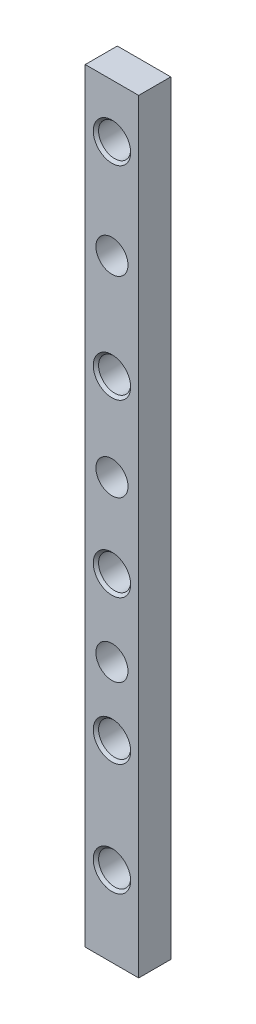
ISO-10303-21;
HEADER;
FILE_DESCRIPTION(('STEP AP214'),'2;1');
FILE_NAME('part.step','',(''),(''),'','','');
FILE_SCHEMA(('AUTOMOTIVE_DESIGN { 1 0 10303 214 1 1 1 1 }'));
ENDSEC;
DATA;
#1=APPLICATION_CONTEXT('core data for automotive mechanical design processes');
#2=APPLICATION_PROTOCOL_DEFINITION('international standard','automotive_design',2000,#1);
#3=PRODUCT_CONTEXT('',#1,'mechanical');
#4=PRODUCT('Part','Part','',(#3));
#5=PRODUCT_RELATED_PRODUCT_CATEGORY('part','',(#4));
#6=PRODUCT_DEFINITION_FORMATION('','',#4);
#7=PRODUCT_DEFINITION_CONTEXT('part definition',#1,'design');
#8=PRODUCT_DEFINITION('design','',#6,#7);
#9=PRODUCT_DEFINITION_SHAPE('','',#8);
#10=(LENGTH_UNIT() NAMED_UNIT(*) SI_UNIT(.MILLI.,.METRE.));
#11=(NAMED_UNIT(*) PLANE_ANGLE_UNIT() SI_UNIT($,.RADIAN.));
#12=(NAMED_UNIT(*) SI_UNIT($,.STERADIAN.) SOLID_ANGLE_UNIT());
#13=UNCERTAINTY_MEASURE_WITH_UNIT(LENGTH_MEASURE(1.E-05),#10,'distance_accuracy_value','');
#14=(GEOMETRIC_REPRESENTATION_CONTEXT(3) GLOBAL_UNCERTAINTY_ASSIGNED_CONTEXT((#13)) GLOBAL_UNIT_ASSIGNED_CONTEXT((#10,
#11,#12)) REPRESENTATION_CONTEXT('',''));
#15=CARTESIAN_POINT('',(0.,0.,0.));
#16=DIRECTION('',(0.,0.,1.));
#17=DIRECTION('',(1.,0.,0.));
#18=AXIS2_PLACEMENT_3D('',#15,#16,#17);
#19=CARTESIAN_POINT('',(0.,0.,6.));
#20=DIRECTION('',(0.,0.,-1.));
#21=DIRECTION('',(-1.,0.,0.));
#22=AXIS2_PLACEMENT_3D('',#19,#20,#21);
#23=PLANE('',#22);
#24=CARTESIAN_POINT('',(0.,61.5,6.));
#25=DIRECTION('',(0.,0.,-1.));
#26=DIRECTION('',(-1.,0.,0.));
#27=AXIS2_PLACEMENT_3D('',#24,#25,#26);
#28=CIRCLE('',#27,3.50000000000002);
#29=CARTESIAN_POINT('',(-3.50000000000002,61.5,6.));
#30=VERTEX_POINT('',#29);
#31=EDGE_CURVE('E129',#30,#30,#28,.T.);
#32=ORIENTED_EDGE('',*,*,#31,.T.);
#33=EDGE_LOOP('',(#32));
#34=FACE_BOUND('',#33,.T.);
#35=CARTESIAN_POINT('',(0.,23.5,6.));
#36=DIRECTION('',(0.,0.,-1.));
#37=DIRECTION('',(-1.,0.,0.));
#38=AXIS2_PLACEMENT_3D('',#35,#36,#37);
#39=CIRCLE('',#38,3.49999999999998);
#40=CARTESIAN_POINT('',(-3.49999999999997,23.5,6.));
#41=VERTEX_POINT('',#40);
#42=EDGE_CURVE('E126',#41,#41,#39,.T.);
#43=ORIENTED_EDGE('',*,*,#42,.T.);
#44=EDGE_LOOP('',(#43));
#45=FACE_BOUND('',#44,.T.);
#46=CARTESIAN_POINT('',(0.,-8.49999999999999,6.));
#47=DIRECTION('',(0.,0.,-1.));
#48=DIRECTION('',(-1.,0.,0.));
#49=AXIS2_PLACEMENT_3D('',#46,#47,#48);
#50=CIRCLE('',#49,3.50000000000003);
#51=CARTESIAN_POINT('',(-3.50000000000002,-8.49999999999999,6.));
#52=VERTEX_POINT('',#51);
#53=EDGE_CURVE('E123',#52,#52,#50,.T.);
#54=ORIENTED_EDGE('',*,*,#53,.T.);
#55=EDGE_LOOP('',(#54));
#56=FACE_BOUND('',#55,.T.);
#57=CARTESIAN_POINT('',(0.,-35.5,6.));
#58=DIRECTION('',(0.,0.,-1.));
#59=DIRECTION('',(-1.,0.,0.));
#60=AXIS2_PLACEMENT_3D('',#57,#58,#59);
#61=CIRCLE('',#60,3.50000000000002);
#62=CARTESIAN_POINT('',(-3.5,-35.5,6.));
#63=VERTEX_POINT('',#62);
#64=EDGE_CURVE('E120',#63,#63,#61,.T.);
#65=ORIENTED_EDGE('',*,*,#64,.T.);
#66=EDGE_LOOP('',(#65));
#67=FACE_BOUND('',#66,.T.);
#68=CARTESIAN_POINT('',(0.,-56.5,6.));
#69=DIRECTION('',(0.,0.,-1.));
#70=DIRECTION('',(-1.,0.,0.));
#71=AXIS2_PLACEMENT_3D('',#68,#69,#70);
#72=CIRCLE('',#71,3.50000000000002);
#73=CARTESIAN_POINT('',(-3.5,-56.5,6.));
#74=VERTEX_POINT('',#73);
#75=EDGE_CURVE('E117',#74,#74,#72,.T.);
#76=ORIENTED_EDGE('',*,*,#75,.T.);
#77=EDGE_LOOP('',(#76));
#78=FACE_BOUND('',#77,.T.);
#79=DIRECTION('',(0.,1.,0.));
#80=VECTOR('',#79,1.);
#81=CARTESIAN_POINT('',(5.00000000000004,-71.5,6.));
#82=LINE('',#81,#80);
#83=CARTESIAN_POINT('',(5.00000000000004,-71.5,6.));
#84=VERTEX_POINT('',#83);
#85=CARTESIAN_POINT('',(5.,71.5,6.));
#86=VERTEX_POINT('',#85);
#87=EDGE_CURVE('E89',#84,#86,#82,.T.);
#88=ORIENTED_EDGE('',*,*,#87,.T.);
#89=DIRECTION('',(-1.,0.,0.));
#90=VECTOR('',#89,1.);
#91=CARTESIAN_POINT('',(-5.,71.5,6.));
#92=LINE('',#91,#90);
#93=CARTESIAN_POINT('',(-5.,71.5,6.));
#94=VERTEX_POINT('',#93);
#95=EDGE_CURVE('E84',#86,#94,#92,.T.);
#96=ORIENTED_EDGE('',*,*,#95,.T.);
#97=DIRECTION('',(0.,-1.,0.));
#98=VECTOR('',#97,1.);
#99=CARTESIAN_POINT('',(-5.,-71.5,6.));
#100=LINE('',#99,#98);
#101=CARTESIAN_POINT('',(-5.,-71.5,6.));
#102=VERTEX_POINT('',#101);
#103=EDGE_CURVE('E87',#94,#102,#100,.T.);
#104=ORIENTED_EDGE('',*,*,#103,.T.);
#105=DIRECTION('',(1.,0.,0.));
#106=VECTOR('',#105,1.);
#107=CARTESIAN_POINT('',(-5.,-71.5,6.));
#108=LINE('',#107,#106);
#109=EDGE_CURVE('E53',#102,#84,#108,.T.);
#110=ORIENTED_EDGE('',*,*,#109,.T.);
#111=EDGE_LOOP('',(#88,#96,#104,#110));
#112=FACE_BOUND('',#111,.T.);
#113=CARTESIAN_POINT('',(0.,43.0047671776049,6.));
#114=DIRECTION('',(0.,0.,1.));
#115=DIRECTION('',(1.,0.,0.));
#116=AXIS2_PLACEMENT_3D('',#113,#114,#115);
#117=CIRCLE('',#116,3.);
#118=CARTESIAN_POINT('',(3.,43.0047671776049,6.));
#119=VERTEX_POINT('',#118);
#120=EDGE_CURVE('E225',#119,#119,#117,.T.);
#121=ORIENTED_EDGE('',*,*,#120,.F.);
#122=EDGE_LOOP('',(#121));
#123=FACE_BOUND('',#122,.T.);
#124=CARTESIAN_POINT('',(0.,7.13774713298321,6.));
#125=DIRECTION('',(0.,0.,1.));
#126=DIRECTION('',(1.,0.,0.));
#127=AXIS2_PLACEMENT_3D('',#124,#125,#126);
#128=CIRCLE('',#127,3.);
#129=CARTESIAN_POINT('',(3.00000000000001,7.13774713298321,6.));
#130=VERTEX_POINT('',#129);
#131=EDGE_CURVE('E276',#130,#130,#128,.T.);
#132=ORIENTED_EDGE('',*,*,#131,.F.);
#133=EDGE_LOOP('',(#132));
#134=FACE_BOUND('',#133,.T.);
#135=CARTESIAN_POINT('',(0.,-22.7932949664496,6.));
#136=DIRECTION('',(0.,0.,1.));
#137=DIRECTION('',(1.,0.,0.));
#138=AXIS2_PLACEMENT_3D('',#135,#136,#137);
#139=CIRCLE('',#138,3.);
#140=CARTESIAN_POINT('',(3.00000000000001,-22.7932949664496,6.));
#141=VERTEX_POINT('',#140);
#142=EDGE_CURVE('E267',#141,#141,#139,.T.);
#143=ORIENTED_EDGE('',*,*,#142,.F.);
#144=EDGE_LOOP('',(#143));
#145=FACE_BOUND('',#144,.T.);
#146=ADVANCED_FACE('F35',(#34,#45,#56,#67,#78,#112,#123,#134,#145),#23,.F.);
#147=CARTESIAN_POINT('',(0.,0.,0.));
#148=DIRECTION('',(0.,0.,-1.));
#149=DIRECTION('',(-1.,0.,0.));
#150=AXIS2_PLACEMENT_3D('',#147,#148,#149);
#151=PLANE('',#150);
#152=CARTESIAN_POINT('',(0.,7.13774713298321,0.));
#153=DIRECTION('',(0.,0.,1.));
#154=DIRECTION('',(1.,0.,0.));
#155=AXIS2_PLACEMENT_3D('',#152,#153,#154);
#156=CIRCLE('',#155,3.);
#157=CARTESIAN_POINT('',(3.00000000000001,7.13774713298321,0.));
#158=VERTEX_POINT('',#157);
#159=EDGE_CURVE('E273',#158,#158,#156,.T.);
#160=ORIENTED_EDGE('',*,*,#159,.T.);
#161=EDGE_LOOP('',(#160));
#162=FACE_BOUND('',#161,.T.);
#163=CARTESIAN_POINT('',(0.,61.5,0.));
#164=DIRECTION('',(0.,0.,1.));
#165=DIRECTION('',(1.,0.,0.));
#166=AXIS2_PLACEMENT_3D('',#163,#164,#165);
#167=CIRCLE('',#166,3.);
#168=CARTESIAN_POINT('',(3.,61.5,0.));
#169=VERTEX_POINT('',#168);
#170=EDGE_CURVE('E219',#169,#169,#167,.T.);
#171=ORIENTED_EDGE('',*,*,#170,.T.);
#172=EDGE_LOOP('',(#171));
#173=FACE_BOUND('',#172,.T.);
#174=CARTESIAN_POINT('',(0.,-8.49999999999999,0.));
#175=DIRECTION('',(0.,0.,1.));
#176=DIRECTION('',(1.,0.,0.));
#177=AXIS2_PLACEMENT_3D('',#174,#175,#176);
#178=CIRCLE('',#177,3.);
#179=CARTESIAN_POINT('',(3.00000000000001,-8.49999999999999,0.));
#180=VERTEX_POINT('',#179);
#181=EDGE_CURVE('E218',#180,#180,#178,.T.);
#182=ORIENTED_EDGE('',*,*,#181,.T.);
#183=EDGE_LOOP('',(#182));
#184=FACE_BOUND('',#183,.T.);
#185=CARTESIAN_POINT('',(0.,-56.5,0.));
#186=DIRECTION('',(0.,0.,1.));
#187=DIRECTION('',(1.,0.,0.));
#188=AXIS2_PLACEMENT_3D('',#185,#186,#187);
#189=CIRCLE('',#188,3.);
#190=CARTESIAN_POINT('',(3.00000000000002,-56.5,0.));
#191=VERTEX_POINT('',#190);
#192=EDGE_CURVE('E107',#191,#191,#189,.T.);
#193=ORIENTED_EDGE('',*,*,#192,.T.);
#194=EDGE_LOOP('',(#193));
#195=FACE_BOUND('',#194,.T.);
#196=DIRECTION('',(0.,1.,0.));
#197=VECTOR('',#196,1.);
#198=CARTESIAN_POINT('',(5.00000000000004,-71.5,0.));
#199=LINE('',#198,#197);
#200=CARTESIAN_POINT('',(5.00000000000004,-71.5,0.));
#201=VERTEX_POINT('',#200);
#202=CARTESIAN_POINT('',(5.,71.5,0.));
#203=VERTEX_POINT('',#202);
#204=EDGE_CURVE('E104',#201,#203,#199,.T.);
#205=ORIENTED_EDGE('',*,*,#204,.F.);
#206=DIRECTION('',(1.,0.,0.));
#207=VECTOR('',#206,1.);
#208=CARTESIAN_POINT('',(-5.,-71.5,0.));
#209=LINE('',#208,#207);
#210=CARTESIAN_POINT('',(-5.,-71.5,0.));
#211=VERTEX_POINT('',#210);
#212=EDGE_CURVE('E76',#211,#201,#209,.T.);
#213=ORIENTED_EDGE('',*,*,#212,.F.);
#214=DIRECTION('',(0.,-1.,0.));
#215=VECTOR('',#214,1.);
#216=CARTESIAN_POINT('',(-5.,-71.5,0.));
#217=LINE('',#216,#215);
#218=CARTESIAN_POINT('',(-5.,71.5,0.));
#219=VERTEX_POINT('',#218);
#220=EDGE_CURVE('E70',#219,#211,#217,.T.);
#221=ORIENTED_EDGE('',*,*,#220,.F.);
#222=DIRECTION('',(-1.,0.,0.));
#223=VECTOR('',#222,1.);
#224=CARTESIAN_POINT('',(-5.,71.5,0.));
#225=LINE('',#224,#223);
#226=EDGE_CURVE('E94',#203,#219,#225,.T.);
#227=ORIENTED_EDGE('',*,*,#226,.F.);
#228=EDGE_LOOP('',(#205,#213,#221,#227));
#229=FACE_BOUND('',#228,.T.);
#230=CARTESIAN_POINT('',(0.,-35.5,0.));
#231=DIRECTION('',(0.,0.,1.));
#232=DIRECTION('',(1.,0.,0.));
#233=AXIS2_PLACEMENT_3D('',#230,#231,#232);
#234=CIRCLE('',#233,3.);
#235=CARTESIAN_POINT('',(3.00000000000002,-35.5,0.));
#236=VERTEX_POINT('',#235);
#237=EDGE_CURVE('E222',#236,#236,#234,.T.);
#238=ORIENTED_EDGE('',*,*,#237,.T.);
#239=EDGE_LOOP('',(#238));
#240=FACE_BOUND('',#239,.T.);
#241=CARTESIAN_POINT('',(0.,23.5,0.));
#242=DIRECTION('',(0.,0.,1.));
#243=DIRECTION('',(1.,0.,0.));
#244=AXIS2_PLACEMENT_3D('',#241,#242,#243);
#245=CIRCLE('',#244,3.);
#246=CARTESIAN_POINT('',(3.00000000000001,23.5,0.));
#247=VERTEX_POINT('',#246);
#248=EDGE_CURVE('E216',#247,#247,#245,.T.);
#249=ORIENTED_EDGE('',*,*,#248,.T.);
#250=EDGE_LOOP('',(#249));
#251=FACE_BOUND('',#250,.T.);
#252=CARTESIAN_POINT('',(0.,43.0047671776049,0.));
#253=DIRECTION('',(0.,0.,1.));
#254=DIRECTION('',(1.,0.,0.));
#255=AXIS2_PLACEMENT_3D('',#252,#253,#254);
#256=CIRCLE('',#255,3.);
#257=CARTESIAN_POINT('',(3.,43.0047671776049,0.));
#258=VERTEX_POINT('',#257);
#259=EDGE_CURVE('E279',#258,#258,#256,.T.);
#260=ORIENTED_EDGE('',*,*,#259,.T.);
#261=EDGE_LOOP('',(#260));
#262=FACE_BOUND('',#261,.T.);
#263=CARTESIAN_POINT('',(0.,-22.7932949664496,0.));
#264=DIRECTION('',(0.,0.,1.));
#265=DIRECTION('',(1.,0.,0.));
#266=AXIS2_PLACEMENT_3D('',#263,#264,#265);
#267=CIRCLE('',#266,3.);
#268=CARTESIAN_POINT('',(3.00000000000001,-22.7932949664496,0.));
#269=VERTEX_POINT('',#268);
#270=EDGE_CURVE('E270',#269,#269,#267,.T.);
#271=ORIENTED_EDGE('',*,*,#270,.T.);
#272=EDGE_LOOP('',(#271));
#273=FACE_BOUND('',#272,.T.);
#274=ADVANCED_FACE('F158',(#162,#173,#184,#195,#229,#240,#251,#262,#273),#151,.T.);
#275=CARTESIAN_POINT('',(5.00000000000004,-71.5,6.));
#276=DIRECTION('',(-1.,0.,0.));
#277=DIRECTION('',(0.,-1.,0.));
#278=AXIS2_PLACEMENT_3D('',#275,#276,#277);
#279=PLANE('',#278);
#280=ORIENTED_EDGE('',*,*,#204,.T.);
#281=DIRECTION('',(0.,0.,-1.));
#282=VECTOR('',#281,1.);
#283=CARTESIAN_POINT('',(5.,71.5,6.));
#284=LINE('',#283,#282);
#285=EDGE_CURVE('E95',#86,#203,#284,.T.);
#286=ORIENTED_EDGE('',*,*,#285,.F.);
#287=ORIENTED_EDGE('',*,*,#87,.F.);
#288=DIRECTION('',(0.,0.,-1.));
#289=VECTOR('',#288,1.);
#290=CARTESIAN_POINT('',(5.00000000000004,-71.5,6.));
#291=LINE('',#290,#289);
#292=EDGE_CURVE('E100',#84,#201,#291,.T.);
#293=ORIENTED_EDGE('',*,*,#292,.T.);
#294=EDGE_LOOP('',(#280,#286,#287,#293));
#295=FACE_BOUND('',#294,.T.);
#296=ADVANCED_FACE('F164',(#295),#279,.F.);
#297=CARTESIAN_POINT('',(-5.,71.5,6.));
#298=DIRECTION('',(0.,-1.,0.));
#299=DIRECTION('',(0.,0.,-1.));
#300=AXIS2_PLACEMENT_3D('',#297,#298,#299);
#301=PLANE('',#300);
#302=ORIENTED_EDGE('',*,*,#226,.T.);
#303=DIRECTION('',(0.,0.,-1.));
#304=VECTOR('',#303,1.);
#305=CARTESIAN_POINT('',(-5.,71.5,6.));
#306=LINE('',#305,#304);
#307=EDGE_CURVE('E92',#94,#219,#306,.T.);
#308=ORIENTED_EDGE('',*,*,#307,.F.);
#309=ORIENTED_EDGE('',*,*,#95,.F.);
#310=ORIENTED_EDGE('',*,*,#285,.T.);
#311=EDGE_LOOP('',(#302,#308,#309,#310));
#312=FACE_BOUND('',#311,.T.);
#313=ADVANCED_FACE('F93',(#312),#301,.F.);
#314=CARTESIAN_POINT('',(-5.,-71.5,6.));
#315=DIRECTION('',(1.,0.,0.));
#316=DIRECTION('',(0.,0.,-1.));
#317=AXIS2_PLACEMENT_3D('',#314,#315,#316);
#318=PLANE('',#317);
#319=ORIENTED_EDGE('',*,*,#220,.T.);
#320=DIRECTION('',(0.,0.,-1.));
#321=VECTOR('',#320,1.);
#322=CARTESIAN_POINT('',(-5.,-71.5,6.));
#323=LINE('',#322,#321);
#324=EDGE_CURVE('E96',#102,#211,#323,.T.);
#325=ORIENTED_EDGE('',*,*,#324,.F.);
#326=ORIENTED_EDGE('',*,*,#103,.F.);
#327=ORIENTED_EDGE('',*,*,#307,.T.);
#328=EDGE_LOOP('',(#319,#325,#326,#327));
#329=FACE_BOUND('',#328,.T.);
#330=ADVANCED_FACE('F98',(#329),#318,.F.);
#331=CARTESIAN_POINT('',(-5.,-71.5,6.));
#332=DIRECTION('',(0.,1.,0.));
#333=DIRECTION('',(0.,0.,1.));
#334=AXIS2_PLACEMENT_3D('',#331,#332,#333);
#335=PLANE('',#334);
#336=ORIENTED_EDGE('',*,*,#212,.T.);
#337=ORIENTED_EDGE('',*,*,#292,.F.);
#338=ORIENTED_EDGE('',*,*,#109,.F.);
#339=ORIENTED_EDGE('',*,*,#324,.T.);
#340=EDGE_LOOP('',(#336,#337,#338,#339));
#341=FACE_BOUND('',#340,.T.);
#342=ADVANCED_FACE('F172',(#341),#335,.F.);
#343=CARTESIAN_POINT('',(0.,-56.5,6.));
#344=DIRECTION('',(0.,0.,-1.));
#345=DIRECTION('',(-1.,0.,0.));
#346=AXIS2_PLACEMENT_3D('',#343,#344,#345);
#347=CYLINDRICAL_SURFACE('',#346,3.);
#348=CARTESIAN_POINT('',(0.,-56.5,5.49999999999999));
#349=DIRECTION('',(0.,0.,-1.));
#350=DIRECTION('',(-1.,0.,0.));
#351=AXIS2_PLACEMENT_3D('',#348,#349,#350);
#352=CIRCLE('',#351,3.);
#353=CARTESIAN_POINT('',(-2.99999999999999,-56.5,5.49999999999999));
#354=VERTEX_POINT('',#353);
#355=EDGE_CURVE('E11',#354,#354,#352,.F.);
#356=ORIENTED_EDGE('',*,*,#355,.T.);
#357=EDGE_LOOP('',(#356));
#358=FACE_BOUND('',#357,.T.);
#359=ORIENTED_EDGE('',*,*,#192,.F.);
#360=EDGE_LOOP('',(#359));
#361=FACE_BOUND('',#360,.T.);
#362=ADVANCED_FACE('F169',(#358,#361),#347,.F.);
#363=CARTESIAN_POINT('',(0.,-35.5,6.));
#364=DIRECTION('',(0.,0.,-1.));
#365=DIRECTION('',(-1.,0.,0.));
#366=AXIS2_PLACEMENT_3D('',#363,#364,#365);
#367=CYLINDRICAL_SURFACE('',#366,3.);
#368=CARTESIAN_POINT('',(0.,-35.5,5.49999999999999));
#369=DIRECTION('',(0.,0.,-1.));
#370=DIRECTION('',(-1.,0.,0.));
#371=AXIS2_PLACEMENT_3D('',#368,#369,#370);
#372=CIRCLE('',#371,3.);
#373=CARTESIAN_POINT('',(-2.99999999999999,-35.5,5.49999999999999));
#374=VERTEX_POINT('',#373);
#375=EDGE_CURVE('E45',#374,#374,#372,.F.);
#376=ORIENTED_EDGE('',*,*,#375,.T.);
#377=EDGE_LOOP('',(#376));
#378=FACE_BOUND('',#377,.T.);
#379=ORIENTED_EDGE('',*,*,#237,.F.);
#380=EDGE_LOOP('',(#379));
#381=FACE_BOUND('',#380,.T.);
#382=ADVANCED_FACE('F140',(#378,#381),#367,.F.);
#383=CARTESIAN_POINT('',(0.,-8.49999999999999,6.));
#384=DIRECTION('',(0.,0.,-1.));
#385=DIRECTION('',(-1.,0.,0.));
#386=AXIS2_PLACEMENT_3D('',#383,#384,#385);
#387=CYLINDRICAL_SURFACE('',#386,3.);
#388=CARTESIAN_POINT('',(0.,-8.49999999999999,5.49999999999996));
#389=DIRECTION('',(0.,0.,-1.));
#390=DIRECTION('',(-1.,0.,0.));
#391=AXIS2_PLACEMENT_3D('',#388,#389,#390);
#392=CIRCLE('',#391,3.);
#393=CARTESIAN_POINT('',(-2.99999999999999,-8.49999999999999,5.49999999999996));
#394=VERTEX_POINT('',#393);
#395=EDGE_CURVE('E135',#394,#394,#392,.F.);
#396=ORIENTED_EDGE('',*,*,#395,.T.);
#397=EDGE_LOOP('',(#396));
#398=FACE_BOUND('',#397,.T.);
#399=ORIENTED_EDGE('',*,*,#181,.F.);
#400=EDGE_LOOP('',(#399));
#401=FACE_BOUND('',#400,.T.);
#402=ADVANCED_FACE('F212',(#398,#401),#387,.F.);
#403=CARTESIAN_POINT('',(0.,23.5,6.));
#404=DIRECTION('',(0.,0.,-1.));
#405=DIRECTION('',(-1.,0.,0.));
#406=AXIS2_PLACEMENT_3D('',#403,#404,#405);
#407=CYLINDRICAL_SURFACE('',#406,3.);
#408=CARTESIAN_POINT('',(0.,23.5,5.50000000000003));
#409=DIRECTION('',(0.,0.,-1.));
#410=DIRECTION('',(-1.,0.,0.));
#411=AXIS2_PLACEMENT_3D('',#408,#409,#410);
#412=CIRCLE('',#411,3.);
#413=CARTESIAN_POINT('',(-2.99999999999999,23.5,5.50000000000003));
#414=VERTEX_POINT('',#413);
#415=EDGE_CURVE('E132',#414,#414,#412,.F.);
#416=ORIENTED_EDGE('',*,*,#415,.T.);
#417=EDGE_LOOP('',(#416));
#418=FACE_BOUND('',#417,.T.);
#419=ORIENTED_EDGE('',*,*,#248,.F.);
#420=EDGE_LOOP('',(#419));
#421=FACE_BOUND('',#420,.T.);
#422=ADVANCED_FACE('F208',(#418,#421),#407,.F.);
#423=CARTESIAN_POINT('',(0.,61.5,6.));
#424=DIRECTION('',(0.,0.,-1.));
#425=DIRECTION('',(-1.,0.,0.));
#426=AXIS2_PLACEMENT_3D('',#423,#424,#425);
#427=CYLINDRICAL_SURFACE('',#426,3.);
#428=CARTESIAN_POINT('',(0.,61.5,5.49999999999999));
#429=DIRECTION('',(0.,0.,-1.));
#430=DIRECTION('',(-1.,0.,0.));
#431=AXIS2_PLACEMENT_3D('',#428,#429,#430);
#432=CIRCLE('',#431,3.);
#433=CARTESIAN_POINT('',(-3.,61.5,5.49999999999999));
#434=VERTEX_POINT('',#433);
#435=EDGE_CURVE('E114',#434,#434,#432,.F.);
#436=ORIENTED_EDGE('',*,*,#435,.T.);
#437=EDGE_LOOP('',(#436));
#438=FACE_BOUND('',#437,.T.);
#439=ORIENTED_EDGE('',*,*,#170,.F.);
#440=EDGE_LOOP('',(#439));
#441=FACE_BOUND('',#440,.T.);
#442=ADVANCED_FACE('F211',(#438,#441),#427,.F.);
#443=CARTESIAN_POINT('',(0.,43.0047671776049,6.));
#444=DIRECTION('',(0.,0.,-1.));
#445=DIRECTION('',(-1.,0.,0.));
#446=AXIS2_PLACEMENT_3D('',#443,#444,#445);
#447=CYLINDRICAL_SURFACE('',#446,3.);
#448=ORIENTED_EDGE('',*,*,#120,.T.);
#449=EDGE_LOOP('',(#448));
#450=FACE_BOUND('',#449,.T.);
#451=ORIENTED_EDGE('',*,*,#259,.F.);
#452=EDGE_LOOP('',(#451));
#453=FACE_BOUND('',#452,.T.);
#454=ADVANCED_FACE('F251',(#450,#453),#447,.F.);
#455=CARTESIAN_POINT('',(0.,7.13774713298321,6.));
#456=DIRECTION('',(0.,0.,-1.));
#457=DIRECTION('',(-1.,0.,0.));
#458=AXIS2_PLACEMENT_3D('',#455,#456,#457);
#459=CYLINDRICAL_SURFACE('',#458,3.);
#460=ORIENTED_EDGE('',*,*,#131,.T.);
#461=EDGE_LOOP('',(#460));
#462=FACE_BOUND('',#461,.T.);
#463=ORIENTED_EDGE('',*,*,#159,.F.);
#464=EDGE_LOOP('',(#463));
#465=FACE_BOUND('',#464,.T.);
#466=ADVANCED_FACE('F255',(#462,#465),#459,.F.);
#467=CARTESIAN_POINT('',(0.,-22.7932949664496,6.));
#468=DIRECTION('',(0.,0.,-1.));
#469=DIRECTION('',(-1.,0.,0.));
#470=AXIS2_PLACEMENT_3D('',#467,#468,#469);
#471=CYLINDRICAL_SURFACE('',#470,3.);
#472=ORIENTED_EDGE('',*,*,#142,.T.);
#473=EDGE_LOOP('',(#472));
#474=FACE_BOUND('',#473,.T.);
#475=ORIENTED_EDGE('',*,*,#270,.F.);
#476=EDGE_LOOP('',(#475));
#477=FACE_BOUND('',#476,.T.);
#478=ADVANCED_FACE('F189',(#474,#477),#471,.F.);
#479=CARTESIAN_POINT('',(0.,61.5,5.49999999999999));
#480=DIRECTION('',(0.,0.,1.));
#481=DIRECTION('',(1.,0.,0.));
#482=AXIS2_PLACEMENT_3D('',#479,#480,#481);
#483=CONICAL_SURFACE('',#482,3.,0.785398163397452);
#484=ORIENTED_EDGE('',*,*,#31,.F.);
#485=EDGE_LOOP('',(#484));
#486=FACE_BOUND('',#485,.T.);
#487=ORIENTED_EDGE('',*,*,#435,.F.);
#488=EDGE_LOOP('',(#487));
#489=FACE_BOUND('',#488,.T.);
#490=ADVANCED_FACE('F183',(#486,#489),#483,.F.);
#491=CARTESIAN_POINT('',(0.,23.5,5.50000000000003));
#492=DIRECTION('',(0.,0.,1.));
#493=DIRECTION('',(1.,0.,0.));
#494=AXIS2_PLACEMENT_3D('',#491,#492,#493);
#495=CONICAL_SURFACE('',#494,3.,0.785398163397451);
#496=ORIENTED_EDGE('',*,*,#42,.F.);
#497=EDGE_LOOP('',(#496));
#498=FACE_BOUND('',#497,.T.);
#499=ORIENTED_EDGE('',*,*,#415,.F.);
#500=EDGE_LOOP('',(#499));
#501=FACE_BOUND('',#500,.T.);
#502=ADVANCED_FACE('F152',(#498,#501),#495,.F.);
#503=CARTESIAN_POINT('',(0.,-8.49999999999999,5.49999999999996));
#504=DIRECTION('',(0.,0.,1.));
#505=DIRECTION('',(1.,0.,0.));
#506=AXIS2_PLACEMENT_3D('',#503,#504,#505);
#507=CONICAL_SURFACE('',#506,3.,0.785398163397438);
#508=ORIENTED_EDGE('',*,*,#53,.F.);
#509=EDGE_LOOP('',(#508));
#510=FACE_BOUND('',#509,.T.);
#511=ORIENTED_EDGE('',*,*,#395,.F.);
#512=EDGE_LOOP('',(#511));
#513=FACE_BOUND('',#512,.T.);
#514=ADVANCED_FACE('F145',(#510,#513),#507,.F.);
#515=CARTESIAN_POINT('',(0.,-35.5,5.49999999999999));
#516=DIRECTION('',(0.,0.,1.));
#517=DIRECTION('',(1.,0.,0.));
#518=AXIS2_PLACEMENT_3D('',#515,#516,#517);
#519=CONICAL_SURFACE('',#518,3.,0.785398163397452);
#520=ORIENTED_EDGE('',*,*,#64,.F.);
#521=EDGE_LOOP('',(#520));
#522=FACE_BOUND('',#521,.T.);
#523=ORIENTED_EDGE('',*,*,#375,.F.);
#524=EDGE_LOOP('',(#523));
#525=FACE_BOUND('',#524,.T.);
#526=ADVANCED_FACE('F143',(#522,#525),#519,.F.);
#527=CARTESIAN_POINT('',(0.,-56.5,5.49999999999999));
#528=DIRECTION('',(0.,0.,1.));
#529=DIRECTION('',(1.,0.,0.));
#530=AXIS2_PLACEMENT_3D('',#527,#528,#529);
#531=CONICAL_SURFACE('',#530,3.,0.785398163397452);
#532=ORIENTED_EDGE('',*,*,#75,.F.);
#533=EDGE_LOOP('',(#532));
#534=FACE_BOUND('',#533,.T.);
#535=ORIENTED_EDGE('',*,*,#355,.F.);
#536=EDGE_LOOP('',(#535));
#537=FACE_BOUND('',#536,.T.);
#538=ADVANCED_FACE('F38',(#534,#537),#531,.F.);
#539=CLOSED_SHELL('',(#146,#274,#296,#313,#330,#342,#362,#382,#402,#422,#442,#454,#466,#478,
#490,#502,#514,#526,#538));
#540=MANIFOLD_SOLID_BREP('B2',#539);
#541=ADVANCED_BREP_SHAPE_REPRESENTATION('',(#18,#540),#14);
#542=SHAPE_DEFINITION_REPRESENTATION(#9,#541);
ENDSEC;
END-ISO-10303-21;
